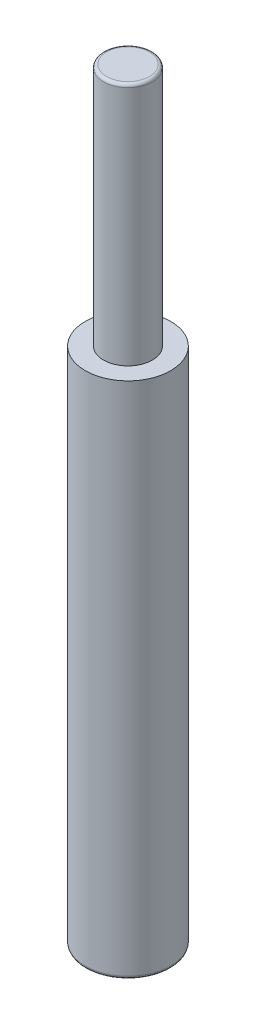
ISO-10303-21;
HEADER;
FILE_DESCRIPTION(('STEP AP214'),'2;1');
FILE_NAME('part.step','',(''),(''),'','','');
FILE_SCHEMA(('AUTOMOTIVE_DESIGN { 1 0 10303 214 1 1 1 1 }'));
ENDSEC;
DATA;
#1=APPLICATION_CONTEXT('core data for automotive mechanical design processes');
#2=APPLICATION_PROTOCOL_DEFINITION('international standard','automotive_design',2000,#1);
#3=PRODUCT_CONTEXT('',#1,'mechanical');
#4=PRODUCT('Part','Part','',(#3));
#5=PRODUCT_RELATED_PRODUCT_CATEGORY('part','',(#4));
#6=PRODUCT_DEFINITION_FORMATION('','',#4);
#7=PRODUCT_DEFINITION_CONTEXT('part definition',#1,'design');
#8=PRODUCT_DEFINITION('design','',#6,#7);
#9=PRODUCT_DEFINITION_SHAPE('','',#8);
#10=(LENGTH_UNIT() NAMED_UNIT(*) SI_UNIT(.MILLI.,.METRE.));
#11=(NAMED_UNIT(*) PLANE_ANGLE_UNIT() SI_UNIT($,.RADIAN.));
#12=(NAMED_UNIT(*) SI_UNIT($,.STERADIAN.) SOLID_ANGLE_UNIT());
#13=UNCERTAINTY_MEASURE_WITH_UNIT(LENGTH_MEASURE(1.E-05),#10,'distance_accuracy_value','');
#14=(GEOMETRIC_REPRESENTATION_CONTEXT(3) GLOBAL_UNCERTAINTY_ASSIGNED_CONTEXT((#13)) GLOBAL_UNIT_ASSIGNED_CONTEXT((#10,
#11,#12)) REPRESENTATION_CONTEXT('',''));
#15=CARTESIAN_POINT('',(0.,0.,0.));
#16=DIRECTION('',(0.,0.,1.));
#17=DIRECTION('',(1.,0.,0.));
#18=AXIS2_PLACEMENT_3D('',#15,#16,#17);
#19=CARTESIAN_POINT('',(0.,40.,0.));
#20=DIRECTION('',(0.,-1.,0.));
#21=DIRECTION('',(0.,0.,-1.));
#22=AXIS2_PLACEMENT_3D('',#19,#20,#21);
#23=CYLINDRICAL_SURFACE('',#22,4.);
#24=CARTESIAN_POINT('',(0.,39.5,0.));
#25=DIRECTION('',(0.,1.,0.));
#26=DIRECTION('',(0.,0.,1.));
#27=AXIS2_PLACEMENT_3D('',#24,#25,#26);
#28=CIRCLE('',#27,4.);
#29=CARTESIAN_POINT('',(0.,39.5,4.));
#30=VERTEX_POINT('',#29);
#31=EDGE_CURVE('E10',#30,#30,#28,.F.);
#32=ORIENTED_EDGE('',*,*,#31,.T.);
#33=EDGE_LOOP('',(#32));
#34=FACE_BOUND('',#33,.T.);
#35=CARTESIAN_POINT('',(0.,0.,0.));
#36=DIRECTION('',(0.,1.,0.));
#37=DIRECTION('',(0.,0.,1.));
#38=AXIS2_PLACEMENT_3D('',#35,#36,#37);
#39=CIRCLE('',#38,4.);
#40=CARTESIAN_POINT('',(0.,0.,4.));
#41=VERTEX_POINT('',#40);
#42=EDGE_CURVE('E63',#41,#41,#39,.T.);
#43=ORIENTED_EDGE('',*,*,#42,.T.);
#44=EDGE_LOOP('',(#43));
#45=FACE_BOUND('',#44,.T.);
#46=ADVANCED_FACE('F39',(#34,#45),#23,.T.);
#47=CARTESIAN_POINT('',(0.,40.,0.));
#48=DIRECTION('',(0.,1.,0.));
#49=DIRECTION('',(0.,0.,1.));
#50=AXIS2_PLACEMENT_3D('',#47,#48,#49);
#51=PLANE('',#50);
#52=CARTESIAN_POINT('',(0.,40.,0.));
#53=DIRECTION('',(0.,1.,0.));
#54=DIRECTION('',(0.,0.,1.));
#55=AXIS2_PLACEMENT_3D('',#52,#53,#54);
#56=CIRCLE('',#55,3.5);
#57=CARTESIAN_POINT('',(0.,40.,3.5));
#58=VERTEX_POINT('',#57);
#59=EDGE_CURVE('E47',#58,#58,#56,.T.);
#60=ORIENTED_EDGE('',*,*,#59,.T.);
#61=EDGE_LOOP('',(#60));
#62=FACE_BOUND('',#61,.T.);
#63=ADVANCED_FACE('F77',(#62),#51,.T.);
#64=CARTESIAN_POINT('',(0.,-85.,0.));
#65=DIRECTION('',(0.,1.,0.));
#66=DIRECTION('',(0.,0.,1.));
#67=AXIS2_PLACEMENT_3D('',#64,#65,#66);
#68=CYLINDRICAL_SURFACE('',#67,7.);
#69=CARTESIAN_POINT('',(0.,-84.5,0.));
#70=DIRECTION('',(0.,1.,0.));
#71=DIRECTION('',(0.,0.,1.));
#72=AXIS2_PLACEMENT_3D('',#69,#70,#71);
#73=CIRCLE('',#72,7.);
#74=CARTESIAN_POINT('',(0.,-84.5,7.));
#75=VERTEX_POINT('',#74);
#76=EDGE_CURVE('E57',#75,#75,#73,.T.);
#77=ORIENTED_EDGE('',*,*,#76,.T.);
#78=EDGE_LOOP('',(#77));
#79=FACE_BOUND('',#78,.T.);
#80=CARTESIAN_POINT('',(0.,0.,0.));
#81=DIRECTION('',(0.,1.,0.));
#82=DIRECTION('',(0.,0.,1.));
#83=AXIS2_PLACEMENT_3D('',#80,#81,#82);
#84=CIRCLE('',#83,7.);
#85=CARTESIAN_POINT('',(0.,0.,7.));
#86=VERTEX_POINT('',#85);
#87=EDGE_CURVE('E67',#86,#86,#84,.T.);
#88=ORIENTED_EDGE('',*,*,#87,.F.);
#89=EDGE_LOOP('',(#88));
#90=FACE_BOUND('',#89,.T.);
#91=ADVANCED_FACE('F74',(#79,#90),#68,.T.);
#92=CARTESIAN_POINT('',(0.,-85.,0.));
#93=DIRECTION('',(0.,1.,0.));
#94=DIRECTION('',(0.,0.,1.));
#95=AXIS2_PLACEMENT_3D('',#92,#93,#94);
#96=PLANE('',#95);
#97=CARTESIAN_POINT('',(0.,-85.,0.));
#98=DIRECTION('',(0.,1.,0.));
#99=DIRECTION('',(0.,0.,1.));
#100=AXIS2_PLACEMENT_3D('',#97,#98,#99);
#101=CIRCLE('',#100,6.5);
#102=CARTESIAN_POINT('',(0.,-85.,6.5));
#103=VERTEX_POINT('',#102);
#104=EDGE_CURVE('E52',#103,#103,#101,.F.);
#105=ORIENTED_EDGE('',*,*,#104,.T.);
#106=EDGE_LOOP('',(#105));
#107=FACE_BOUND('',#106,.T.);
#108=ADVANCED_FACE('F76',(#107),#96,.F.);
#109=CARTESIAN_POINT('',(0.,0.,0.));
#110=DIRECTION('',(0.,1.,0.));
#111=DIRECTION('',(0.,0.,1.));
#112=AXIS2_PLACEMENT_3D('',#109,#110,#111);
#113=PLANE('',#112);
#114=ORIENTED_EDGE('',*,*,#42,.F.);
#115=EDGE_LOOP('',(#114));
#116=FACE_BOUND('',#115,.T.);
#117=ORIENTED_EDGE('',*,*,#87,.T.);
#118=EDGE_LOOP('',(#117));
#119=FACE_BOUND('',#118,.T.);
#120=ADVANCED_FACE('F72',(#116,#119),#113,.T.);
#121=CARTESIAN_POINT('',(0.,-84.5,0.));
#122=DIRECTION('',(0.,1.,0.));
#123=DIRECTION('',(0.,0.,1.));
#124=AXIS2_PLACEMENT_3D('',#121,#122,#123);
#125=TOROIDAL_SURFACE('',#124,6.5,0.5);
#126=ORIENTED_EDGE('',*,*,#104,.F.);
#127=EDGE_LOOP('',(#126));
#128=FACE_BOUND('',#127,.T.);
#129=ORIENTED_EDGE('',*,*,#76,.F.);
#130=EDGE_LOOP('',(#129));
#131=FACE_BOUND('',#130,.T.);
#132=ADVANCED_FACE('F93',(#128,#131),#125,.T.);
#133=CARTESIAN_POINT('',(0.,39.5,0.));
#134=DIRECTION('',(0.,1.,0.));
#135=DIRECTION('',(0.,0.,1.));
#136=AXIS2_PLACEMENT_3D('',#133,#134,#135);
#137=TOROIDAL_SURFACE('',#136,3.5,0.5);
#138=ORIENTED_EDGE('',*,*,#31,.F.);
#139=EDGE_LOOP('',(#138));
#140=FACE_BOUND('',#139,.T.);
#141=ORIENTED_EDGE('',*,*,#59,.F.);
#142=EDGE_LOOP('',(#141));
#143=FACE_BOUND('',#142,.T.);
#144=ADVANCED_FACE('F41',(#140,#143),#137,.T.);
#145=CLOSED_SHELL('',(#46,#63,#91,#108,#120,#132,#144));
#146=MANIFOLD_SOLID_BREP('B2',#145);
#147=ADVANCED_BREP_SHAPE_REPRESENTATION('',(#18,#146),#14);
#148=SHAPE_DEFINITION_REPRESENTATION(#9,#147);
ENDSEC;
END-ISO-10303-21;
